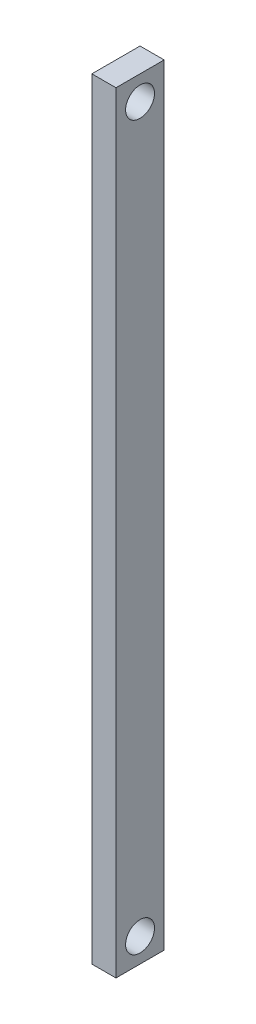
ISO-10303-21;
HEADER;
FILE_DESCRIPTION(('STEP AP214'),'2;1');
FILE_NAME('part.step','',(''),(''),'','','');
FILE_SCHEMA(('AUTOMOTIVE_DESIGN { 1 0 10303 214 1 1 1 1 }'));
ENDSEC;
DATA;
#1=APPLICATION_CONTEXT('core data for automotive mechanical design processes');
#2=APPLICATION_PROTOCOL_DEFINITION('international standard','automotive_design',2000,#1);
#3=PRODUCT_CONTEXT('',#1,'mechanical');
#4=PRODUCT('Part','Part','',(#3));
#5=PRODUCT_RELATED_PRODUCT_CATEGORY('part','',(#4));
#6=PRODUCT_DEFINITION_FORMATION('','',#4);
#7=PRODUCT_DEFINITION_CONTEXT('part definition',#1,'design');
#8=PRODUCT_DEFINITION('design','',#6,#7);
#9=PRODUCT_DEFINITION_SHAPE('','',#8);
#10=(LENGTH_UNIT() NAMED_UNIT(*) SI_UNIT(.MILLI.,.METRE.));
#11=(NAMED_UNIT(*) PLANE_ANGLE_UNIT() SI_UNIT($,.RADIAN.));
#12=(NAMED_UNIT(*) SI_UNIT($,.STERADIAN.) SOLID_ANGLE_UNIT());
#13=UNCERTAINTY_MEASURE_WITH_UNIT(LENGTH_MEASURE(1.E-05),#10,'distance_accuracy_value','');
#14=(GEOMETRIC_REPRESENTATION_CONTEXT(3) GLOBAL_UNCERTAINTY_ASSIGNED_CONTEXT((#13)) GLOBAL_UNIT_ASSIGNED_CONTEXT((#10,
#11,#12)) REPRESENTATION_CONTEXT('',''));
#15=CARTESIAN_POINT('',(0.,0.,0.));
#16=DIRECTION('',(0.,0.,1.));
#17=DIRECTION('',(1.,0.,0.));
#18=AXIS2_PLACEMENT_3D('',#15,#16,#17);
#19=CARTESIAN_POINT('',(5.,-80.,-5.));
#20=DIRECTION('',(0.,0.,1.));
#21=DIRECTION('',(1.,0.,0.));
#22=AXIS2_PLACEMENT_3D('',#19,#20,#21);
#23=PLANE('',#22);
#24=DIRECTION('',(0.,1.,0.));
#25=VECTOR('',#24,1.);
#26=CARTESIAN_POINT('',(0.,-80.,-5.));
#27=LINE('',#26,#25);
#28=CARTESIAN_POINT('',(0.,-80.,-5.));
#29=VERTEX_POINT('',#28);
#30=CARTESIAN_POINT('',(0.,80.,-5.));
#31=VERTEX_POINT('',#30);
#32=EDGE_CURVE('E96',#29,#31,#27,.T.);
#33=ORIENTED_EDGE('',*,*,#32,.T.);
#34=DIRECTION('',(-1.,0.,0.));
#35=VECTOR('',#34,1.);
#36=CARTESIAN_POINT('',(5.,80.,-5.));
#37=LINE('',#36,#35);
#38=CARTESIAN_POINT('',(5.,80.,-5.));
#39=VERTEX_POINT('',#38);
#40=EDGE_CURVE('E11',#39,#31,#37,.T.);
#41=ORIENTED_EDGE('',*,*,#40,.F.);
#42=DIRECTION('',(0.,1.,0.));
#43=VECTOR('',#42,1.);
#44=CARTESIAN_POINT('',(5.,-80.,-5.));
#45=LINE('',#44,#43);
#46=CARTESIAN_POINT('',(5.,-80.,-5.));
#47=VERTEX_POINT('',#46);
#48=EDGE_CURVE('E84',#47,#39,#45,.T.);
#49=ORIENTED_EDGE('',*,*,#48,.F.);
#50=DIRECTION('',(-1.,0.,0.));
#51=VECTOR('',#50,1.);
#52=CARTESIAN_POINT('',(5.,-80.,-5.));
#53=LINE('',#52,#51);
#54=EDGE_CURVE('E92',#47,#29,#53,.T.);
#55=ORIENTED_EDGE('',*,*,#54,.T.);
#56=EDGE_LOOP('',(#33,#41,#49,#55));
#57=FACE_BOUND('',#56,.T.);
#58=ADVANCED_FACE('F33',(#57),#23,.F.);
#59=CARTESIAN_POINT('',(5.,80.,5.));
#60=DIRECTION('',(0.,-1.,0.));
#61=DIRECTION('',(0.,0.,-1.));
#62=AXIS2_PLACEMENT_3D('',#59,#60,#61);
#63=PLANE('',#62);
#64=DIRECTION('',(0.,0.,1.));
#65=VECTOR('',#64,1.);
#66=CARTESIAN_POINT('',(0.,80.,5.));
#67=LINE('',#66,#65);
#68=CARTESIAN_POINT('',(0.,80.,5.));
#69=VERTEX_POINT('',#68);
#70=EDGE_CURVE('E88',#31,#69,#67,.T.);
#71=ORIENTED_EDGE('',*,*,#70,.T.);
#72=DIRECTION('',(-1.,0.,0.));
#73=VECTOR('',#72,1.);
#74=CARTESIAN_POINT('',(5.,80.,5.));
#75=LINE('',#74,#73);
#76=CARTESIAN_POINT('',(5.,80.,5.));
#77=VERTEX_POINT('',#76);
#78=EDGE_CURVE('E41',#77,#69,#75,.T.);
#79=ORIENTED_EDGE('',*,*,#78,.F.);
#80=DIRECTION('',(0.,0.,1.));
#81=VECTOR('',#80,1.);
#82=CARTESIAN_POINT('',(5.,80.,5.));
#83=LINE('',#82,#81);
#84=EDGE_CURVE('E79',#39,#77,#83,.T.);
#85=ORIENTED_EDGE('',*,*,#84,.F.);
#86=ORIENTED_EDGE('',*,*,#40,.T.);
#87=EDGE_LOOP('',(#71,#79,#85,#86));
#88=FACE_BOUND('',#87,.T.);
#89=ADVANCED_FACE('F87',(#88),#63,.F.);
#90=CARTESIAN_POINT('',(5.,-80.,5.));
#91=DIRECTION('',(0.,0.,-1.));
#92=DIRECTION('',(-1.,0.,0.));
#93=AXIS2_PLACEMENT_3D('',#90,#91,#92);
#94=PLANE('',#93);
#95=DIRECTION('',(0.,-1.,0.));
#96=VECTOR('',#95,1.);
#97=CARTESIAN_POINT('',(0.,-80.,5.));
#98=LINE('',#97,#96);
#99=CARTESIAN_POINT('',(0.,-80.,5.));
#100=VERTEX_POINT('',#99);
#101=EDGE_CURVE('E66',#69,#100,#98,.T.);
#102=ORIENTED_EDGE('',*,*,#101,.T.);
#103=DIRECTION('',(-1.,0.,0.));
#104=VECTOR('',#103,1.);
#105=CARTESIAN_POINT('',(5.,-80.,5.));
#106=LINE('',#105,#104);
#107=CARTESIAN_POINT('',(5.,-80.,5.));
#108=VERTEX_POINT('',#107);
#109=EDGE_CURVE('E89',#108,#100,#106,.T.);
#110=ORIENTED_EDGE('',*,*,#109,.F.);
#111=DIRECTION('',(0.,-1.,0.));
#112=VECTOR('',#111,1.);
#113=CARTESIAN_POINT('',(5.,-80.,5.));
#114=LINE('',#113,#112);
#115=EDGE_CURVE('E82',#77,#108,#114,.T.);
#116=ORIENTED_EDGE('',*,*,#115,.F.);
#117=ORIENTED_EDGE('',*,*,#78,.T.);
#118=EDGE_LOOP('',(#102,#110,#116,#117));
#119=FACE_BOUND('',#118,.T.);
#120=ADVANCED_FACE('F90',(#119),#94,.F.);
#121=CARTESIAN_POINT('',(5.,-80.,5.));
#122=DIRECTION('',(0.,1.,0.));
#123=DIRECTION('',(0.,0.,1.));
#124=AXIS2_PLACEMENT_3D('',#121,#122,#123);
#125=PLANE('',#124);
#126=DIRECTION('',(0.,0.,-1.));
#127=VECTOR('',#126,1.);
#128=CARTESIAN_POINT('',(0.,-80.,5.));
#129=LINE('',#128,#127);
#130=EDGE_CURVE('E72',#100,#29,#129,.T.);
#131=ORIENTED_EDGE('',*,*,#130,.T.);
#132=ORIENTED_EDGE('',*,*,#54,.F.);
#133=DIRECTION('',(0.,0.,-1.));
#134=VECTOR('',#133,1.);
#135=CARTESIAN_POINT('',(5.,-80.,5.));
#136=LINE('',#135,#134);
#137=EDGE_CURVE('E49',#108,#47,#136,.T.);
#138=ORIENTED_EDGE('',*,*,#137,.F.);
#139=ORIENTED_EDGE('',*,*,#109,.T.);
#140=EDGE_LOOP('',(#131,#132,#138,#139));
#141=FACE_BOUND('',#140,.T.);
#142=ADVANCED_FACE('F104',(#141),#125,.F.);
#143=CARTESIAN_POINT('',(5.,0.,0.));
#144=DIRECTION('',(-1.,0.,0.));
#145=DIRECTION('',(0.,0.,1.));
#146=AXIS2_PLACEMENT_3D('',#143,#144,#145);
#147=PLANE('',#146);
#148=CARTESIAN_POINT('',(5.,-75.,-1.20456106190088E-12));
#149=DIRECTION('',(1.,0.,0.));
#150=DIRECTION('',(0.,0.,-1.));
#151=AXIS2_PLACEMENT_3D('',#148,#149,#150);
#152=CIRCLE('',#151,3.);
#153=CARTESIAN_POINT('',(5.,-75.,-3.00000000000121));
#154=VERTEX_POINT('',#153);
#155=EDGE_CURVE('E118',#154,#154,#152,.T.);
#156=ORIENTED_EDGE('',*,*,#155,.F.);
#157=EDGE_LOOP('',(#156));
#158=FACE_BOUND('',#157,.T.);
#159=CARTESIAN_POINT('',(5.,75.,0.));
#160=DIRECTION('',(1.,0.,0.));
#161=DIRECTION('',(0.,0.,-1.));
#162=AXIS2_PLACEMENT_3D('',#159,#160,#161);
#163=CIRCLE('',#162,3.);
#164=CARTESIAN_POINT('',(5.,75.,-3.));
#165=VERTEX_POINT('',#164);
#166=EDGE_CURVE('E112',#165,#165,#163,.T.);
#167=ORIENTED_EDGE('',*,*,#166,.F.);
#168=EDGE_LOOP('',(#167));
#169=FACE_BOUND('',#168,.T.);
#170=ORIENTED_EDGE('',*,*,#48,.T.);
#171=ORIENTED_EDGE('',*,*,#84,.T.);
#172=ORIENTED_EDGE('',*,*,#115,.T.);
#173=ORIENTED_EDGE('',*,*,#137,.T.);
#174=EDGE_LOOP('',(#170,#171,#172,#173));
#175=FACE_BOUND('',#174,.T.);
#176=ADVANCED_FACE('F80',(#158,#169,#175),#147,.F.);
#177=CARTESIAN_POINT('',(0.,0.,0.));
#178=DIRECTION('',(-1.,0.,0.));
#179=DIRECTION('',(0.,0.,1.));
#180=AXIS2_PLACEMENT_3D('',#177,#178,#179);
#181=PLANE('',#180);
#182=CARTESIAN_POINT('',(0.,-75.,-1.20456106190088E-12));
#183=DIRECTION('',(-1.,0.,0.));
#184=DIRECTION('',(0.,0.,1.));
#185=AXIS2_PLACEMENT_3D('',#182,#183,#184);
#186=CIRCLE('',#185,3.);
#187=CARTESIAN_POINT('',(0.,-75.,2.9999999999988));
#188=VERTEX_POINT('',#187);
#189=EDGE_CURVE('E115',#188,#188,#186,.F.);
#190=ORIENTED_EDGE('',*,*,#189,.T.);
#191=EDGE_LOOP('',(#190));
#192=FACE_BOUND('',#191,.T.);
#193=CARTESIAN_POINT('',(0.,75.,0.));
#194=DIRECTION('',(-1.,0.,0.));
#195=DIRECTION('',(0.,0.,1.));
#196=AXIS2_PLACEMENT_3D('',#193,#194,#195);
#197=CIRCLE('',#196,3.);
#198=CARTESIAN_POINT('',(0.,75.,3.));
#199=VERTEX_POINT('',#198);
#200=EDGE_CURVE('E99',#199,#199,#197,.F.);
#201=ORIENTED_EDGE('',*,*,#200,.T.);
#202=EDGE_LOOP('',(#201));
#203=FACE_BOUND('',#202,.T.);
#204=ORIENTED_EDGE('',*,*,#32,.F.);
#205=ORIENTED_EDGE('',*,*,#130,.F.);
#206=ORIENTED_EDGE('',*,*,#101,.F.);
#207=ORIENTED_EDGE('',*,*,#70,.F.);
#208=EDGE_LOOP('',(#204,#205,#206,#207));
#209=FACE_BOUND('',#208,.T.);
#210=ADVANCED_FACE('F107',(#192,#203,#209),#181,.T.);
#211=CARTESIAN_POINT('',(-8.48528137423858,75.,0.));
#212=DIRECTION('',(1.,0.,0.));
#213=DIRECTION('',(0.,0.,-1.));
#214=AXIS2_PLACEMENT_3D('',#211,#212,#213);
#215=CYLINDRICAL_SURFACE('',#214,3.);
#216=ORIENTED_EDGE('',*,*,#166,.T.);
#217=EDGE_LOOP('',(#216));
#218=FACE_BOUND('',#217,.T.);
#219=ORIENTED_EDGE('',*,*,#200,.F.);
#220=EDGE_LOOP('',(#219));
#221=FACE_BOUND('',#220,.T.);
#222=ADVANCED_FACE('F130',(#218,#221),#215,.F.);
#223=CARTESIAN_POINT('',(-8.48528137423858,-75.,-1.20456106190088E-12));
#224=DIRECTION('',(1.,0.,0.));
#225=DIRECTION('',(0.,0.,-1.));
#226=AXIS2_PLACEMENT_3D('',#223,#224,#225);
#227=CYLINDRICAL_SURFACE('',#226,3.);
#228=ORIENTED_EDGE('',*,*,#155,.T.);
#229=EDGE_LOOP('',(#228));
#230=FACE_BOUND('',#229,.T.);
#231=ORIENTED_EDGE('',*,*,#189,.F.);
#232=EDGE_LOOP('',(#231));
#233=FACE_BOUND('',#232,.T.);
#234=ADVANCED_FACE('F122',(#230,#233),#227,.F.);
#235=CLOSED_SHELL('',(#58,#89,#120,#142,#176,#210,#222,#234));
#236=MANIFOLD_SOLID_BREP('B2',#235);
#237=ADVANCED_BREP_SHAPE_REPRESENTATION('',(#18,#236),#14);
#238=SHAPE_DEFINITION_REPRESENTATION(#9,#237);
ENDSEC;
END-ISO-10303-21;
